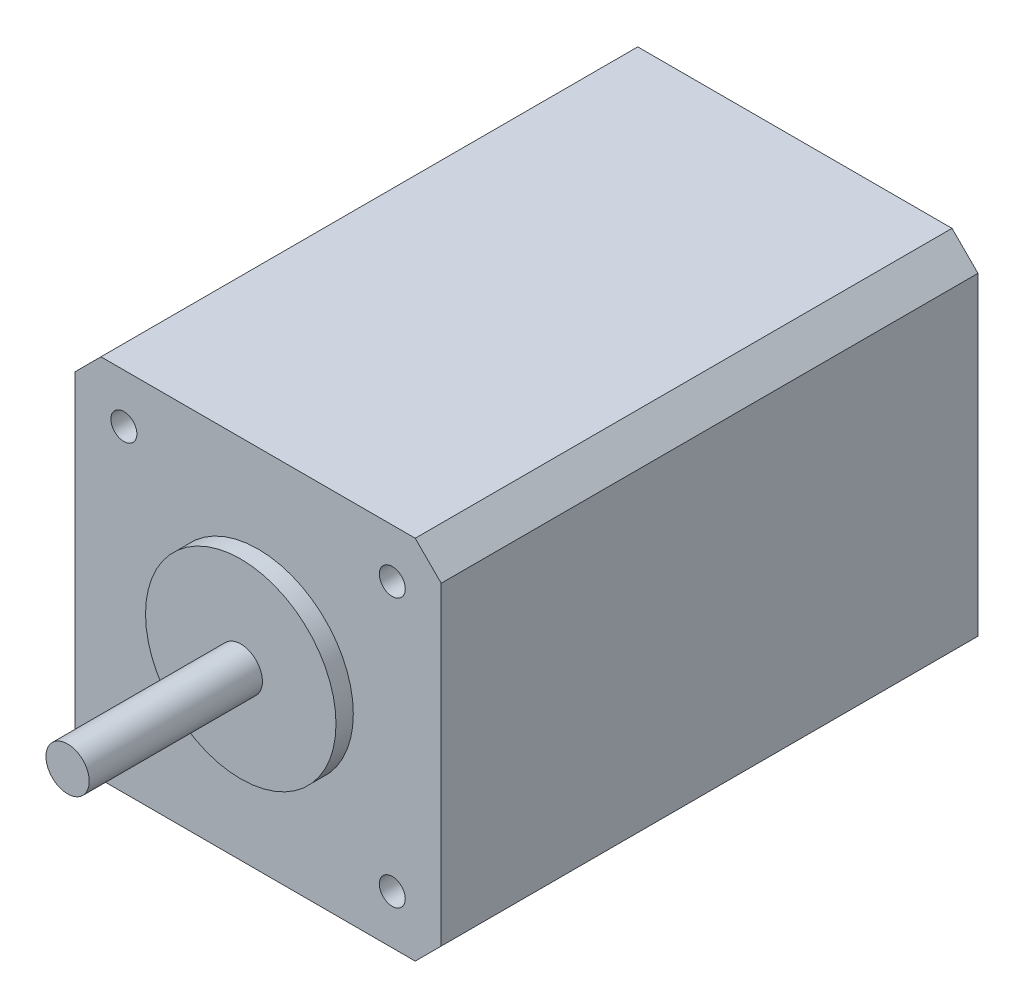
ISO-10303-21;
HEADER;
FILE_DESCRIPTION(('STEP AP214'),'2;1');
FILE_NAME('part.step','',(''),(''),'','','');
FILE_SCHEMA(('AUTOMOTIVE_DESIGN { 1 0 10303 214 1 1 1 1 }'));
ENDSEC;
DATA;
#1=APPLICATION_CONTEXT('core data for automotive mechanical design processes');
#2=APPLICATION_PROTOCOL_DEFINITION('international standard','automotive_design',2000,#1);
#3=PRODUCT_CONTEXT('',#1,'mechanical');
#4=PRODUCT('Part','Part','',(#3));
#5=PRODUCT_RELATED_PRODUCT_CATEGORY('part','',(#4));
#6=PRODUCT_DEFINITION_FORMATION('','',#4);
#7=PRODUCT_DEFINITION_CONTEXT('part definition',#1,'design');
#8=PRODUCT_DEFINITION('design','',#6,#7);
#9=PRODUCT_DEFINITION_SHAPE('','',#8);
#10=(LENGTH_UNIT() NAMED_UNIT(*) SI_UNIT(.MILLI.,.METRE.));
#11=(NAMED_UNIT(*) PLANE_ANGLE_UNIT() SI_UNIT($,.RADIAN.));
#12=(NAMED_UNIT(*) SI_UNIT($,.STERADIAN.) SOLID_ANGLE_UNIT());
#13=UNCERTAINTY_MEASURE_WITH_UNIT(LENGTH_MEASURE(1.E-05),#10,'distance_accuracy_value','');
#14=(GEOMETRIC_REPRESENTATION_CONTEXT(3) GLOBAL_UNCERTAINTY_ASSIGNED_CONTEXT((#13)) GLOBAL_UNIT_ASSIGNED_CONTEXT((#10,
#11,#12)) REPRESENTATION_CONTEXT('',''));
#15=CARTESIAN_POINT('',(0.,0.,0.));
#16=DIRECTION('',(0.,0.,1.));
#17=DIRECTION('',(1.,0.,0.));
#18=AXIS2_PLACEMENT_3D('',#15,#16,#17);
#19=CARTESIAN_POINT('',(21.15,21.15,62.));
#20=DIRECTION('',(-1.,0.,0.));
#21=DIRECTION('',(0.,-1.,0.));
#22=AXIS2_PLACEMENT_3D('',#19,#20,#21);
#23=PLANE('',#22);
#24=DIRECTION('',(0.,1.,0.));
#25=VECTOR('',#24,1.);
#26=CARTESIAN_POINT('',(21.15,21.15,0.));
#27=LINE('',#26,#25);
#28=CARTESIAN_POINT('',(21.15,-18.15,0.));
#29=VERTEX_POINT('',#28);
#30=CARTESIAN_POINT('',(21.15,18.15,0.));
#31=VERTEX_POINT('',#30);
#32=EDGE_CURVE('E126',#29,#31,#27,.T.);
#33=ORIENTED_EDGE('',*,*,#32,.T.);
#34=DIRECTION('',(0.,0.,1.));
#35=VECTOR('',#34,1.);
#36=CARTESIAN_POINT('',(21.15,18.15,62.));
#37=LINE('',#36,#35);
#38=CARTESIAN_POINT('',(21.15,18.15,62.));
#39=VERTEX_POINT('',#38);
#40=EDGE_CURVE('E104',#31,#39,#37,.T.);
#41=ORIENTED_EDGE('',*,*,#40,.T.);
#42=DIRECTION('',(0.,1.,0.));
#43=VECTOR('',#42,1.);
#44=CARTESIAN_POINT('',(21.15,21.15,62.));
#45=LINE('',#44,#43);
#46=CARTESIAN_POINT('',(21.15,-18.15,62.));
#47=VERTEX_POINT('',#46);
#48=EDGE_CURVE('E136',#47,#39,#45,.T.);
#49=ORIENTED_EDGE('',*,*,#48,.F.);
#50=DIRECTION('',(0.,0.,-1.));
#51=VECTOR('',#50,1.);
#52=CARTESIAN_POINT('',(21.15,-18.15,62.));
#53=LINE('',#52,#51);
#54=EDGE_CURVE('E109',#47,#29,#53,.T.);
#55=ORIENTED_EDGE('',*,*,#54,.T.);
#56=EDGE_LOOP('',(#33,#41,#49,#55));
#57=FACE_BOUND('',#56,.T.);
#58=ADVANCED_FACE('F34',(#57),#23,.F.);
#59=CARTESIAN_POINT('',(-21.15,21.15,62.));
#60=DIRECTION('',(0.,-1.,0.));
#61=DIRECTION('',(0.,0.,-1.));
#62=AXIS2_PLACEMENT_3D('',#59,#60,#61);
#63=PLANE('',#62);
#64=DIRECTION('',(-1.,0.,0.));
#65=VECTOR('',#64,1.);
#66=CARTESIAN_POINT('',(-21.15,21.15,62.));
#67=LINE('',#66,#65);
#68=CARTESIAN_POINT('',(18.15,21.15,62.));
#69=VERTEX_POINT('',#68);
#70=CARTESIAN_POINT('',(-18.15,21.15,62.));
#71=VERTEX_POINT('',#70);
#72=EDGE_CURVE('E119',#69,#71,#67,.T.);
#73=ORIENTED_EDGE('',*,*,#72,.F.);
#74=DIRECTION('',(0.,0.,-1.));
#75=VECTOR('',#74,1.);
#76=CARTESIAN_POINT('',(18.15,21.15,62.));
#77=LINE('',#76,#75);
#78=CARTESIAN_POINT('',(18.15,21.15,0.));
#79=VERTEX_POINT('',#78);
#80=EDGE_CURVE('E103',#69,#79,#77,.T.);
#81=ORIENTED_EDGE('',*,*,#80,.T.);
#82=DIRECTION('',(-1.,0.,0.));
#83=VECTOR('',#82,1.);
#84=CARTESIAN_POINT('',(-21.15,21.15,0.));
#85=LINE('',#84,#83);
#86=CARTESIAN_POINT('',(-18.15,21.15,0.));
#87=VERTEX_POINT('',#86);
#88=EDGE_CURVE('E116',#79,#87,#85,.T.);
#89=ORIENTED_EDGE('',*,*,#88,.T.);
#90=DIRECTION('',(0.,0.,1.));
#91=VECTOR('',#90,1.);
#92=CARTESIAN_POINT('',(-18.15,21.15,62.));
#93=LINE('',#92,#91);
#94=EDGE_CURVE('E121',#87,#71,#93,.T.);
#95=ORIENTED_EDGE('',*,*,#94,.T.);
#96=EDGE_LOOP('',(#73,#81,#89,#95));
#97=FACE_BOUND('',#96,.T.);
#98=ADVANCED_FACE('F115',(#97),#63,.F.);
#99=CARTESIAN_POINT('',(-21.15,21.15,62.));
#100=DIRECTION('',(1.,0.,0.));
#101=DIRECTION('',(0.,1.,0.));
#102=AXIS2_PLACEMENT_3D('',#99,#100,#101);
#103=PLANE('',#102);
#104=DIRECTION('',(0.,-1.,0.));
#105=VECTOR('',#104,1.);
#106=CARTESIAN_POINT('',(-21.15,21.15,62.));
#107=LINE('',#106,#105);
#108=CARTESIAN_POINT('',(-21.15,18.15,62.));
#109=VERTEX_POINT('',#108);
#110=CARTESIAN_POINT('',(-21.15,-18.15,62.));
#111=VERTEX_POINT('',#110);
#112=EDGE_CURVE('E171',#109,#111,#107,.T.);
#113=ORIENTED_EDGE('',*,*,#112,.F.);
#114=DIRECTION('',(0.,0.,-1.));
#115=VECTOR('',#114,1.);
#116=CARTESIAN_POINT('',(-21.15,18.15,62.));
#117=LINE('',#116,#115);
#118=CARTESIAN_POINT('',(-21.15,18.15,0.));
#119=VERTEX_POINT('',#118);
#120=EDGE_CURVE('E155',#109,#119,#117,.T.);
#121=ORIENTED_EDGE('',*,*,#120,.T.);
#122=DIRECTION('',(0.,-1.,0.));
#123=VECTOR('',#122,1.);
#124=CARTESIAN_POINT('',(-21.15,21.15,0.));
#125=LINE('',#124,#123);
#126=CARTESIAN_POINT('',(-21.15,-18.15,0.));
#127=VERTEX_POINT('',#126);
#128=EDGE_CURVE('E125',#119,#127,#125,.T.);
#129=ORIENTED_EDGE('',*,*,#128,.T.);
#130=DIRECTION('',(0.,0.,1.));
#131=VECTOR('',#130,1.);
#132=CARTESIAN_POINT('',(-21.15,-18.15,62.));
#133=LINE('',#132,#131);
#134=EDGE_CURVE('E153',#127,#111,#133,.T.);
#135=ORIENTED_EDGE('',*,*,#134,.T.);
#136=EDGE_LOOP('',(#113,#121,#129,#135));
#137=FACE_BOUND('',#136,.T.);
#138=ADVANCED_FACE('F252',(#137),#103,.F.);
#139=CARTESIAN_POINT('',(-21.15,-21.15,62.));
#140=DIRECTION('',(0.,1.,0.));
#141=DIRECTION('',(0.,0.,1.));
#142=AXIS2_PLACEMENT_3D('',#139,#140,#141);
#143=PLANE('',#142);
#144=DIRECTION('',(1.,0.,0.));
#145=VECTOR('',#144,1.);
#146=CARTESIAN_POINT('',(-21.15,-21.15,0.));
#147=LINE('',#146,#145);
#148=CARTESIAN_POINT('',(-18.15,-21.15,0.));
#149=VERTEX_POINT('',#148);
#150=CARTESIAN_POINT('',(18.15,-21.15,0.));
#151=VERTEX_POINT('',#150);
#152=EDGE_CURVE('E129',#149,#151,#147,.T.);
#153=ORIENTED_EDGE('',*,*,#152,.T.);
#154=DIRECTION('',(0.,0.,1.));
#155=VECTOR('',#154,1.);
#156=CARTESIAN_POINT('',(18.15,-21.15,62.));
#157=LINE('',#156,#155);
#158=CARTESIAN_POINT('',(18.15,-21.15,62.));
#159=VERTEX_POINT('',#158);
#160=EDGE_CURVE('E11',#151,#159,#157,.T.);
#161=ORIENTED_EDGE('',*,*,#160,.T.);
#162=DIRECTION('',(1.,0.,0.));
#163=VECTOR('',#162,1.);
#164=CARTESIAN_POINT('',(-21.15,-21.15,62.));
#165=LINE('',#164,#163);
#166=CARTESIAN_POINT('',(-18.15,-21.15,62.));
#167=VERTEX_POINT('',#166);
#168=EDGE_CURVE('E161',#167,#159,#165,.T.);
#169=ORIENTED_EDGE('',*,*,#168,.F.);
#170=DIRECTION('',(0.,0.,-1.));
#171=VECTOR('',#170,1.);
#172=CARTESIAN_POINT('',(-18.15,-21.15,62.));
#173=LINE('',#172,#171);
#174=EDGE_CURVE('E42',#167,#149,#173,.T.);
#175=ORIENTED_EDGE('',*,*,#174,.T.);
#176=EDGE_LOOP('',(#153,#161,#169,#175));
#177=FACE_BOUND('',#176,.T.);
#178=ADVANCED_FACE('F160',(#177),#143,.F.);
#179=CARTESIAN_POINT('',(0.,0.,62.));
#180=DIRECTION('',(0.,0.,1.));
#181=DIRECTION('',(1.,0.,0.));
#182=AXIS2_PLACEMENT_3D('',#179,#180,#181);
#183=PLANE('',#182);
#184=CARTESIAN_POINT('',(-15.5,-15.5,62.));
#185=DIRECTION('',(0.,0.,1.));
#186=DIRECTION('',(1.,0.,0.));
#187=AXIS2_PLACEMENT_3D('',#184,#185,#186);
#188=CIRCLE('',#187,1.5);
#189=CARTESIAN_POINT('',(-14.,-15.5,62.));
#190=VERTEX_POINT('',#189);
#191=EDGE_CURVE('E209',#190,#190,#188,.T.);
#192=ORIENTED_EDGE('',*,*,#191,.F.);
#193=EDGE_LOOP('',(#192));
#194=FACE_BOUND('',#193,.T.);
#195=CARTESIAN_POINT('',(15.5,15.5,62.));
#196=DIRECTION('',(0.,0.,1.));
#197=DIRECTION('',(1.,0.,0.));
#198=AXIS2_PLACEMENT_3D('',#195,#196,#197);
#199=CIRCLE('',#198,1.5);
#200=CARTESIAN_POINT('',(17.,15.5,62.));
#201=VERTEX_POINT('',#200);
#202=EDGE_CURVE('E202',#201,#201,#199,.T.);
#203=ORIENTED_EDGE('',*,*,#202,.F.);
#204=EDGE_LOOP('',(#203));
#205=FACE_BOUND('',#204,.T.);
#206=CARTESIAN_POINT('',(-15.5,15.5,62.));
#207=DIRECTION('',(0.,0.,1.));
#208=DIRECTION('',(1.,0.,0.));
#209=AXIS2_PLACEMENT_3D('',#206,#207,#208);
#210=CIRCLE('',#209,1.5);
#211=CARTESIAN_POINT('',(-14.,15.5,62.));
#212=VERTEX_POINT('',#211);
#213=EDGE_CURVE('E214',#212,#212,#210,.T.);
#214=ORIENTED_EDGE('',*,*,#213,.F.);
#215=EDGE_LOOP('',(#214));
#216=FACE_BOUND('',#215,.T.);
#217=CARTESIAN_POINT('',(15.5,-15.5,62.));
#218=DIRECTION('',(0.,0.,1.));
#219=DIRECTION('',(1.,0.,0.));
#220=AXIS2_PLACEMENT_3D('',#217,#218,#219);
#221=CIRCLE('',#220,1.5);
#222=CARTESIAN_POINT('',(17.,-15.5,62.));
#223=VERTEX_POINT('',#222);
#224=EDGE_CURVE('E195',#223,#223,#221,.T.);
#225=ORIENTED_EDGE('',*,*,#224,.F.);
#226=EDGE_LOOP('',(#225));
#227=FACE_BOUND('',#226,.T.);
#228=CARTESIAN_POINT('',(0.,0.,62.));
#229=DIRECTION('',(0.,0.,1.));
#230=DIRECTION('',(1.,0.,0.));
#231=AXIS2_PLACEMENT_3D('',#228,#229,#230);
#232=CIRCLE('',#231,11.);
#233=CARTESIAN_POINT('',(11.,0.,62.));
#234=VERTEX_POINT('',#233);
#235=EDGE_CURVE('E174',#234,#234,#232,.T.);
#236=ORIENTED_EDGE('',*,*,#235,.F.);
#237=EDGE_LOOP('',(#236));
#238=FACE_BOUND('',#237,.T.);
#239=ORIENTED_EDGE('',*,*,#48,.T.);
#240=DIRECTION('',(0.707106781186546,-0.707106781186549,0.));
#241=VECTOR('',#240,1.);
#242=CARTESIAN_POINT('',(19.65,19.65,62.));
#243=LINE('',#242,#241);
#244=EDGE_CURVE('E151',#39,#69,#243,.F.);
#245=ORIENTED_EDGE('',*,*,#244,.T.);
#246=ORIENTED_EDGE('',*,*,#72,.T.);
#247=DIRECTION('',(0.707106781186549,0.707106781186546,0.));
#248=VECTOR('',#247,1.);
#249=CARTESIAN_POINT('',(-19.65,19.65,62.));
#250=LINE('',#249,#248);
#251=EDGE_CURVE('E149',#71,#109,#250,.F.);
#252=ORIENTED_EDGE('',*,*,#251,.T.);
#253=ORIENTED_EDGE('',*,*,#112,.T.);
#254=DIRECTION('',(-0.707106781186546,0.707106781186549,0.));
#255=VECTOR('',#254,1.);
#256=CARTESIAN_POINT('',(-19.65,-19.6499999999999,62.));
#257=LINE('',#256,#255);
#258=EDGE_CURVE('E54',#111,#167,#257,.F.);
#259=ORIENTED_EDGE('',*,*,#258,.T.);
#260=ORIENTED_EDGE('',*,*,#168,.T.);
#261=DIRECTION('',(-0.70710678118655,-0.707106781186545,0.));
#262=VECTOR('',#261,1.);
#263=CARTESIAN_POINT('',(19.6499999999999,-19.6500000000001,62.));
#264=LINE('',#263,#262);
#265=EDGE_CURVE('E147',#159,#47,#264,.F.);
#266=ORIENTED_EDGE('',*,*,#265,.T.);
#267=EDGE_LOOP('',(#239,#245,#246,#252,#253,#259,#260,#266));
#268=FACE_BOUND('',#267,.T.);
#269=ADVANCED_FACE('F229',(#194,#205,#216,#227,#238,#268),#183,.T.);
#270=CARTESIAN_POINT('',(0.,0.,0.));
#271=DIRECTION('',(0.,0.,1.));
#272=DIRECTION('',(1.,0.,0.));
#273=AXIS2_PLACEMENT_3D('',#270,#271,#272);
#274=PLANE('',#273);
#275=ORIENTED_EDGE('',*,*,#88,.F.);
#276=DIRECTION('',(-0.707106781186546,0.707106781186549,0.));
#277=VECTOR('',#276,1.);
#278=CARTESIAN_POINT('',(18.15,21.15,0.));
#279=LINE('',#278,#277);
#280=EDGE_CURVE('E99',#79,#31,#279,.F.);
#281=ORIENTED_EDGE('',*,*,#280,.T.);
#282=ORIENTED_EDGE('',*,*,#32,.F.);
#283=DIRECTION('',(0.70710678118655,0.707106781186545,0.));
#284=VECTOR('',#283,1.);
#285=CARTESIAN_POINT('',(21.15,-18.15,0.));
#286=LINE('',#285,#284);
#287=EDGE_CURVE('E140',#29,#151,#286,.F.);
#288=ORIENTED_EDGE('',*,*,#287,.T.);
#289=ORIENTED_EDGE('',*,*,#152,.F.);
#290=DIRECTION('',(0.707106781186546,-0.707106781186549,0.));
#291=VECTOR('',#290,1.);
#292=CARTESIAN_POINT('',(-18.15,-21.15,0.));
#293=LINE('',#292,#291);
#294=EDGE_CURVE('E120',#149,#127,#293,.F.);
#295=ORIENTED_EDGE('',*,*,#294,.T.);
#296=ORIENTED_EDGE('',*,*,#128,.F.);
#297=DIRECTION('',(-0.707106781186549,-0.707106781186546,0.));
#298=VECTOR('',#297,1.);
#299=CARTESIAN_POINT('',(-21.15,18.15,0.));
#300=LINE('',#299,#298);
#301=EDGE_CURVE('E110',#119,#87,#300,.F.);
#302=ORIENTED_EDGE('',*,*,#301,.T.);
#303=EDGE_LOOP('',(#275,#281,#282,#288,#289,#295,#296,#302));
#304=FACE_BOUND('',#303,.T.);
#305=ADVANCED_FACE('F123',(#304),#274,.F.);
#306=CARTESIAN_POINT('',(0.,0.,64.));
#307=DIRECTION('',(0.,0.,-1.));
#308=DIRECTION('',(-1.,0.,0.));
#309=AXIS2_PLACEMENT_3D('',#306,#307,#308);
#310=CYLINDRICAL_SURFACE('',#309,11.);
#311=CARTESIAN_POINT('',(0.,0.,64.));
#312=DIRECTION('',(0.,0.,1.));
#313=DIRECTION('',(1.,0.,0.));
#314=AXIS2_PLACEMENT_3D('',#311,#312,#313);
#315=CIRCLE('',#314,11.);
#316=CARTESIAN_POINT('',(11.,0.,64.));
#317=VERTEX_POINT('',#316);
#318=EDGE_CURVE('E131',#317,#317,#315,.T.);
#319=ORIENTED_EDGE('',*,*,#318,.F.);
#320=EDGE_LOOP('',(#319));
#321=FACE_BOUND('',#320,.T.);
#322=ORIENTED_EDGE('',*,*,#235,.T.);
#323=EDGE_LOOP('',(#322));
#324=FACE_BOUND('',#323,.T.);
#325=ADVANCED_FACE('F362',(#321,#324),#310,.T.);
#326=CARTESIAN_POINT('',(0.,0.,64.));
#327=DIRECTION('',(0.,0.,1.));
#328=DIRECTION('',(1.,0.,0.));
#329=AXIS2_PLACEMENT_3D('',#326,#327,#328);
#330=PLANE('',#329);
#331=CARTESIAN_POINT('',(0.,0.,64.));
#332=DIRECTION('',(0.,0.,1.));
#333=DIRECTION('',(1.,0.,0.));
#334=AXIS2_PLACEMENT_3D('',#331,#332,#333);
#335=CIRCLE('',#334,2.5);
#336=CARTESIAN_POINT('',(2.5,0.,64.));
#337=VERTEX_POINT('',#336);
#338=EDGE_CURVE('E137',#337,#337,#335,.T.);
#339=ORIENTED_EDGE('',*,*,#338,.F.);
#340=EDGE_LOOP('',(#339));
#341=FACE_BOUND('',#340,.T.);
#342=ORIENTED_EDGE('',*,*,#318,.T.);
#343=EDGE_LOOP('',(#342));
#344=FACE_BOUND('',#343,.T.);
#345=ADVANCED_FACE('F369',(#341,#344),#330,.T.);
#346=CARTESIAN_POINT('',(0.,0.,84.));
#347=DIRECTION('',(0.,0.,-1.));
#348=DIRECTION('',(-1.,0.,0.));
#349=AXIS2_PLACEMENT_3D('',#346,#347,#348);
#350=CYLINDRICAL_SURFACE('',#349,2.5);
#351=CARTESIAN_POINT('',(0.,0.,84.));
#352=DIRECTION('',(0.,0.,1.));
#353=DIRECTION('',(1.,0.,0.));
#354=AXIS2_PLACEMENT_3D('',#351,#352,#353);
#355=CIRCLE('',#354,2.5);
#356=CARTESIAN_POINT('',(2.5,0.,84.));
#357=VERTEX_POINT('',#356);
#358=EDGE_CURVE('E185',#357,#357,#355,.T.);
#359=ORIENTED_EDGE('',*,*,#358,.F.);
#360=EDGE_LOOP('',(#359));
#361=FACE_BOUND('',#360,.T.);
#362=ORIENTED_EDGE('',*,*,#338,.T.);
#363=EDGE_LOOP('',(#362));
#364=FACE_BOUND('',#363,.T.);
#365=ADVANCED_FACE('F377',(#361,#364),#350,.T.);
#366=CARTESIAN_POINT('',(0.,0.,84.));
#367=DIRECTION('',(0.,0.,1.));
#368=DIRECTION('',(1.,0.,0.));
#369=AXIS2_PLACEMENT_3D('',#366,#367,#368);
#370=PLANE('',#369);
#371=ORIENTED_EDGE('',*,*,#358,.T.);
#372=EDGE_LOOP('',(#371));
#373=FACE_BOUND('',#372,.T.);
#374=ADVANCED_FACE('F259',(#373),#370,.T.);
#375=CARTESIAN_POINT('',(18.15,21.15,62.));
#376=DIRECTION('',(-0.707106781186549,-0.707106781186546,0.));
#377=DIRECTION('',(0.,0.,-1.));
#378=AXIS2_PLACEMENT_3D('',#375,#376,#377);
#379=PLANE('',#378);
#380=ORIENTED_EDGE('',*,*,#244,.F.);
#381=ORIENTED_EDGE('',*,*,#40,.F.);
#382=ORIENTED_EDGE('',*,*,#280,.F.);
#383=ORIENTED_EDGE('',*,*,#80,.F.);
#384=EDGE_LOOP('',(#380,#381,#382,#383));
#385=FACE_BOUND('',#384,.T.);
#386=ADVANCED_FACE('F102',(#385),#379,.F.);
#387=CARTESIAN_POINT('',(-21.15,18.15,62.));
#388=DIRECTION('',(0.707106781186546,-0.707106781186549,0.));
#389=DIRECTION('',(0.,0.,-1.));
#390=AXIS2_PLACEMENT_3D('',#387,#388,#389);
#391=PLANE('',#390);
#392=ORIENTED_EDGE('',*,*,#251,.F.);
#393=ORIENTED_EDGE('',*,*,#94,.F.);
#394=ORIENTED_EDGE('',*,*,#301,.F.);
#395=ORIENTED_EDGE('',*,*,#120,.F.);
#396=EDGE_LOOP('',(#392,#393,#394,#395));
#397=FACE_BOUND('',#396,.T.);
#398=ADVANCED_FACE('F258',(#397),#391,.F.);
#399=CARTESIAN_POINT('',(21.15,-18.15,62.));
#400=DIRECTION('',(-0.707106781186545,0.70710678118655,0.));
#401=DIRECTION('',(0.,0.,-1.));
#402=AXIS2_PLACEMENT_3D('',#399,#400,#401);
#403=PLANE('',#402);
#404=ORIENTED_EDGE('',*,*,#265,.F.);
#405=ORIENTED_EDGE('',*,*,#160,.F.);
#406=ORIENTED_EDGE('',*,*,#287,.F.);
#407=ORIENTED_EDGE('',*,*,#54,.F.);
#408=EDGE_LOOP('',(#404,#405,#406,#407));
#409=FACE_BOUND('',#408,.T.);
#410=ADVANCED_FACE('F166',(#409),#403,.F.);
#411=CARTESIAN_POINT('',(-18.15,-21.15,62.));
#412=DIRECTION('',(0.707106781186549,0.707106781186546,0.));
#413=DIRECTION('',(0.,0.,-1.));
#414=AXIS2_PLACEMENT_3D('',#411,#412,#413);
#415=PLANE('',#414);
#416=ORIENTED_EDGE('',*,*,#258,.F.);
#417=ORIENTED_EDGE('',*,*,#134,.F.);
#418=ORIENTED_EDGE('',*,*,#294,.F.);
#419=ORIENTED_EDGE('',*,*,#174,.F.);
#420=EDGE_LOOP('',(#416,#417,#418,#419));
#421=FACE_BOUND('',#420,.T.);
#422=ADVANCED_FACE('F36',(#421),#415,.F.);
#423=CARTESIAN_POINT('',(15.5,-15.5,52.));
#424=DIRECTION('',(0.,0.,1.));
#425=DIRECTION('',(1.,0.,0.));
#426=AXIS2_PLACEMENT_3D('',#423,#424,#425);
#427=CYLINDRICAL_SURFACE('',#426,1.5);
#428=CARTESIAN_POINT('',(15.5,-15.5,52.));
#429=DIRECTION('',(0.,0.,1.));
#430=DIRECTION('',(1.,0.,0.));
#431=AXIS2_PLACEMENT_3D('',#428,#429,#430);
#432=CIRCLE('',#431,1.5);
#433=CARTESIAN_POINT('',(17.,-15.5,52.));
#434=VERTEX_POINT('',#433);
#435=EDGE_CURVE('E191',#434,#434,#432,.T.);
#436=ORIENTED_EDGE('',*,*,#435,.F.);
#437=EDGE_LOOP('',(#436));
#438=FACE_BOUND('',#437,.T.);
#439=ORIENTED_EDGE('',*,*,#224,.T.);
#440=EDGE_LOOP('',(#439));
#441=FACE_BOUND('',#440,.T.);
#442=ADVANCED_FACE('F237',(#438,#441),#427,.F.);
#443=CARTESIAN_POINT('',(15.5,-15.5,52.));
#444=DIRECTION('',(0.,0.,1.));
#445=DIRECTION('',(1.,0.,0.));
#446=AXIS2_PLACEMENT_3D('',#443,#444,#445);
#447=PLANE('',#446);
#448=ORIENTED_EDGE('',*,*,#435,.T.);
#449=EDGE_LOOP('',(#448));
#450=FACE_BOUND('',#449,.T.);
#451=ADVANCED_FACE('F225',(#450),#447,.T.);
#452=CARTESIAN_POINT('',(-15.5,15.5,52.));
#453=DIRECTION('',(0.,0.,1.));
#454=DIRECTION('',(1.,0.,0.));
#455=AXIS2_PLACEMENT_3D('',#452,#453,#454);
#456=CYLINDRICAL_SURFACE('',#455,1.5);
#457=CARTESIAN_POINT('',(-15.5,15.5,52.));
#458=DIRECTION('',(0.,0.,1.));
#459=DIRECTION('',(1.,0.,0.));
#460=AXIS2_PLACEMENT_3D('',#457,#458,#459);
#461=CIRCLE('',#460,1.5);
#462=CARTESIAN_POINT('',(-14.,15.5,52.));
#463=VERTEX_POINT('',#462);
#464=EDGE_CURVE('E206',#463,#463,#461,.T.);
#465=ORIENTED_EDGE('',*,*,#464,.F.);
#466=EDGE_LOOP('',(#465));
#467=FACE_BOUND('',#466,.T.);
#468=ORIENTED_EDGE('',*,*,#213,.T.);
#469=EDGE_LOOP('',(#468));
#470=FACE_BOUND('',#469,.T.);
#471=ADVANCED_FACE('F222',(#467,#470),#456,.F.);
#472=CARTESIAN_POINT('',(-15.5,15.5,52.));
#473=DIRECTION('',(0.,0.,1.));
#474=DIRECTION('',(1.,0.,0.));
#475=AXIS2_PLACEMENT_3D('',#472,#473,#474);
#476=PLANE('',#475);
#477=ORIENTED_EDGE('',*,*,#464,.T.);
#478=EDGE_LOOP('',(#477));
#479=FACE_BOUND('',#478,.T.);
#480=ADVANCED_FACE('F220',(#479),#476,.T.);
#481=CARTESIAN_POINT('',(15.5,15.5,52.));
#482=DIRECTION('',(0.,0.,1.));
#483=DIRECTION('',(1.,0.,0.));
#484=AXIS2_PLACEMENT_3D('',#481,#482,#483);
#485=CYLINDRICAL_SURFACE('',#484,1.5);
#486=CARTESIAN_POINT('',(15.5,15.5,52.));
#487=DIRECTION('',(0.,0.,1.));
#488=DIRECTION('',(1.,0.,0.));
#489=AXIS2_PLACEMENT_3D('',#486,#487,#488);
#490=CIRCLE('',#489,1.5);
#491=CARTESIAN_POINT('',(17.,15.5,52.));
#492=VERTEX_POINT('',#491);
#493=EDGE_CURVE('E205',#492,#492,#490,.T.);
#494=ORIENTED_EDGE('',*,*,#493,.F.);
#495=EDGE_LOOP('',(#494));
#496=FACE_BOUND('',#495,.T.);
#497=ORIENTED_EDGE('',*,*,#202,.T.);
#498=EDGE_LOOP('',(#497));
#499=FACE_BOUND('',#498,.T.);
#500=ADVANCED_FACE('F306',(#496,#499),#485,.F.);
#501=CARTESIAN_POINT('',(15.5,15.5,52.));
#502=DIRECTION('',(0.,0.,1.));
#503=DIRECTION('',(1.,0.,0.));
#504=AXIS2_PLACEMENT_3D('',#501,#502,#503);
#505=PLANE('',#504);
#506=ORIENTED_EDGE('',*,*,#493,.T.);
#507=EDGE_LOOP('',(#506));
#508=FACE_BOUND('',#507,.T.);
#509=ADVANCED_FACE('F315',(#508),#505,.T.);
#510=CARTESIAN_POINT('',(-15.5,-15.5,52.));
#511=DIRECTION('',(0.,0.,1.));
#512=DIRECTION('',(1.,0.,0.));
#513=AXIS2_PLACEMENT_3D('',#510,#511,#512);
#514=CYLINDRICAL_SURFACE('',#513,1.5);
#515=CARTESIAN_POINT('',(-15.5,-15.5,52.));
#516=DIRECTION('',(0.,0.,1.));
#517=DIRECTION('',(1.,0.,0.));
#518=AXIS2_PLACEMENT_3D('',#515,#516,#517);
#519=CIRCLE('',#518,1.5);
#520=CARTESIAN_POINT('',(-14.,-15.5,52.));
#521=VERTEX_POINT('',#520);
#522=EDGE_CURVE('E200',#521,#521,#519,.T.);
#523=ORIENTED_EDGE('',*,*,#522,.F.);
#524=EDGE_LOOP('',(#523));
#525=FACE_BOUND('',#524,.T.);
#526=ORIENTED_EDGE('',*,*,#191,.T.);
#527=EDGE_LOOP('',(#526));
#528=FACE_BOUND('',#527,.T.);
#529=ADVANCED_FACE('F325',(#525,#528),#514,.F.);
#530=CARTESIAN_POINT('',(-15.5,-15.5,52.));
#531=DIRECTION('',(0.,0.,1.));
#532=DIRECTION('',(1.,0.,0.));
#533=AXIS2_PLACEMENT_3D('',#530,#531,#532);
#534=PLANE('',#533);
#535=ORIENTED_EDGE('',*,*,#522,.T.);
#536=EDGE_LOOP('',(#535));
#537=FACE_BOUND('',#536,.T.);
#538=ADVANCED_FACE('F335',(#537),#534,.T.);
#539=CLOSED_SHELL('',(#58,#98,#138,#178,#269,#305,#325,#345,#365,#374,#386,#398,#410,#422,#442,
#451,#471,#480,#500,#509,#529,#538));
#540=MANIFOLD_SOLID_BREP('B2',#539);
#541=ADVANCED_BREP_SHAPE_REPRESENTATION('',(#18,#540),#14);
#542=SHAPE_DEFINITION_REPRESENTATION(#9,#541);
ENDSEC;
END-ISO-10303-21;
